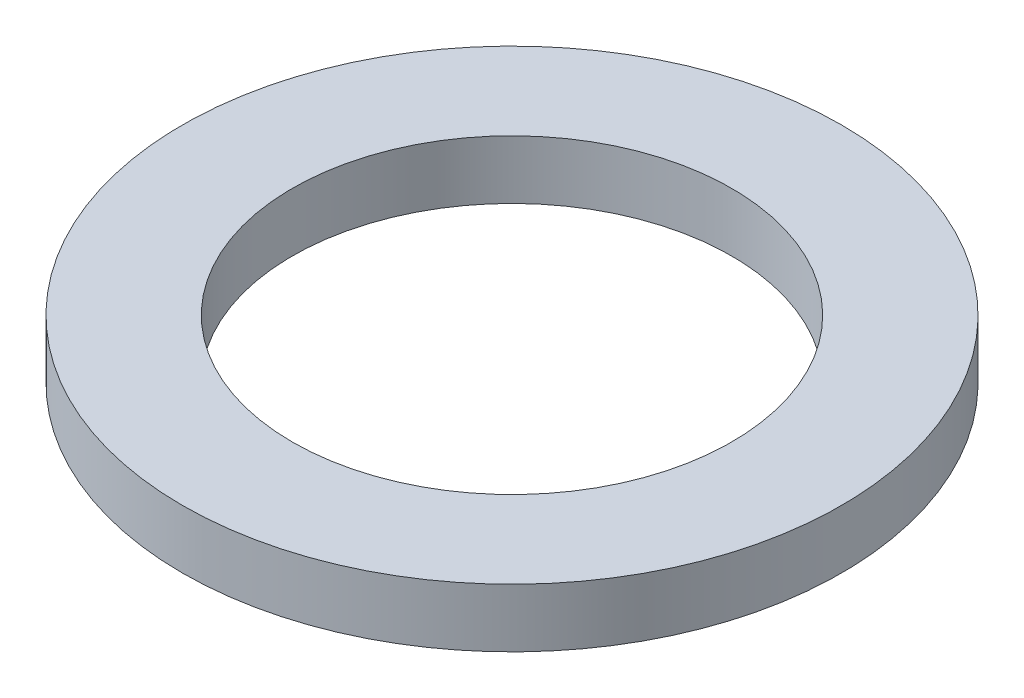
ISO-10303-21;
HEADER;
FILE_DESCRIPTION(('STEP AP214'),'2;1');
FILE_NAME('part.step','',(''),(''),'','','');
FILE_SCHEMA(('AUTOMOTIVE_DESIGN { 1 0 10303 214 1 1 1 1 }'));
ENDSEC;
DATA;
#1=APPLICATION_CONTEXT('core data for automotive mechanical design processes');
#2=APPLICATION_PROTOCOL_DEFINITION('international standard','automotive_design',2000,#1);
#3=PRODUCT_CONTEXT('',#1,'mechanical');
#4=PRODUCT('Part','Part','',(#3));
#5=PRODUCT_RELATED_PRODUCT_CATEGORY('part','',(#4));
#6=PRODUCT_DEFINITION_FORMATION('','',#4);
#7=PRODUCT_DEFINITION_CONTEXT('part definition',#1,'design');
#8=PRODUCT_DEFINITION('design','',#6,#7);
#9=PRODUCT_DEFINITION_SHAPE('','',#8);
#10=(LENGTH_UNIT() NAMED_UNIT(*) SI_UNIT(.MILLI.,.METRE.));
#11=(NAMED_UNIT(*) PLANE_ANGLE_UNIT() SI_UNIT($,.RADIAN.));
#12=(NAMED_UNIT(*) SI_UNIT($,.STERADIAN.) SOLID_ANGLE_UNIT());
#13=UNCERTAINTY_MEASURE_WITH_UNIT(LENGTH_MEASURE(1.E-05),#10,'distance_accuracy_value','');
#14=(GEOMETRIC_REPRESENTATION_CONTEXT(3) GLOBAL_UNCERTAINTY_ASSIGNED_CONTEXT((#13)) GLOBAL_UNIT_ASSIGNED_CONTEXT((#10,
#11,#12)) REPRESENTATION_CONTEXT('',''));
#15=CARTESIAN_POINT('',(0.,0.,0.));
#16=DIRECTION('',(0.,0.,1.));
#17=DIRECTION('',(1.,0.,0.));
#18=AXIS2_PLACEMENT_3D('',#15,#16,#17);
#19=CARTESIAN_POINT('',(0.,8.,0.));
#20=DIRECTION('',(0.,-1.,0.));
#21=DIRECTION('',(0.,0.,-1.));
#22=AXIS2_PLACEMENT_3D('',#19,#20,#21);
#23=CYLINDRICAL_SURFACE('',#22,45.);
#24=CARTESIAN_POINT('',(0.,8.,0.));
#25=DIRECTION('',(0.,1.,0.));
#26=DIRECTION('',(0.,0.,1.));
#27=AXIS2_PLACEMENT_3D('',#24,#25,#26);
#28=CIRCLE('',#27,45.);
#29=CARTESIAN_POINT('',(0.,8.,45.));
#30=VERTEX_POINT('',#29);
#31=EDGE_CURVE('E10',#30,#30,#28,.T.);
#32=ORIENTED_EDGE('',*,*,#31,.F.);
#33=EDGE_LOOP('',(#32));
#34=FACE_BOUND('',#33,.T.);
#35=CARTESIAN_POINT('',(0.,0.,0.));
#36=DIRECTION('',(0.,1.,0.));
#37=DIRECTION('',(0.,0.,1.));
#38=AXIS2_PLACEMENT_3D('',#35,#36,#37);
#39=CIRCLE('',#38,45.);
#40=CARTESIAN_POINT('',(0.,0.,45.));
#41=VERTEX_POINT('',#40);
#42=EDGE_CURVE('E37',#41,#41,#39,.T.);
#43=ORIENTED_EDGE('',*,*,#42,.T.);
#44=EDGE_LOOP('',(#43));
#45=FACE_BOUND('',#44,.T.);
#46=ADVANCED_FACE('F40',(#34,#45),#23,.T.);
#47=CARTESIAN_POINT('',(0.,8.,0.));
#48=DIRECTION('',(0.,1.,0.));
#49=DIRECTION('',(0.,0.,1.));
#50=AXIS2_PLACEMENT_3D('',#47,#48,#49);
#51=PLANE('',#50);
#52=CARTESIAN_POINT('',(0.,8.,0.));
#53=DIRECTION('',(0.,1.,0.));
#54=DIRECTION('',(0.,0.,1.));
#55=AXIS2_PLACEMENT_3D('',#52,#53,#54);
#56=CIRCLE('',#55,30.);
#57=CARTESIAN_POINT('',(0.,8.,30.));
#58=VERTEX_POINT('',#57);
#59=EDGE_CURVE('E50',#58,#58,#56,.T.);
#60=ORIENTED_EDGE('',*,*,#59,.F.);
#61=EDGE_LOOP('',(#60));
#62=FACE_BOUND('',#61,.T.);
#63=ORIENTED_EDGE('',*,*,#31,.T.);
#64=EDGE_LOOP('',(#63));
#65=FACE_BOUND('',#64,.T.);
#66=ADVANCED_FACE('F59',(#62,#65),#51,.T.);
#67=CARTESIAN_POINT('',(0.,0.,0.));
#68=DIRECTION('',(0.,1.,0.));
#69=DIRECTION('',(0.,0.,1.));
#70=AXIS2_PLACEMENT_3D('',#67,#68,#69);
#71=PLANE('',#70);
#72=CARTESIAN_POINT('',(0.,0.,0.));
#73=DIRECTION('',(0.,1.,0.));
#74=DIRECTION('',(0.,0.,1.));
#75=AXIS2_PLACEMENT_3D('',#72,#73,#74);
#76=CIRCLE('',#75,30.);
#77=CARTESIAN_POINT('',(0.,0.,30.));
#78=VERTEX_POINT('',#77);
#79=EDGE_CURVE('E47',#78,#78,#76,.T.);
#80=ORIENTED_EDGE('',*,*,#79,.T.);
#81=EDGE_LOOP('',(#80));
#82=FACE_BOUND('',#81,.T.);
#83=ORIENTED_EDGE('',*,*,#42,.F.);
#84=EDGE_LOOP('',(#83));
#85=FACE_BOUND('',#84,.T.);
#86=ADVANCED_FACE('F58',(#82,#85),#71,.F.);
#87=CARTESIAN_POINT('',(0.,8.,0.));
#88=DIRECTION('',(0.,-1.,0.));
#89=DIRECTION('',(0.,0.,-1.));
#90=AXIS2_PLACEMENT_3D('',#87,#88,#89);
#91=CYLINDRICAL_SURFACE('',#90,30.);
#92=ORIENTED_EDGE('',*,*,#59,.T.);
#93=EDGE_LOOP('',(#92));
#94=FACE_BOUND('',#93,.T.);
#95=ORIENTED_EDGE('',*,*,#79,.F.);
#96=EDGE_LOOP('',(#95));
#97=FACE_BOUND('',#96,.T.);
#98=ADVANCED_FACE('F54',(#94,#97),#91,.F.);
#99=CLOSED_SHELL('',(#46,#66,#86,#98));
#100=MANIFOLD_SOLID_BREP('B2',#99);
#101=ADVANCED_BREP_SHAPE_REPRESENTATION('',(#18,#100),#14);
#102=SHAPE_DEFINITION_REPRESENTATION(#9,#101);
ENDSEC;
END-ISO-10303-21;
